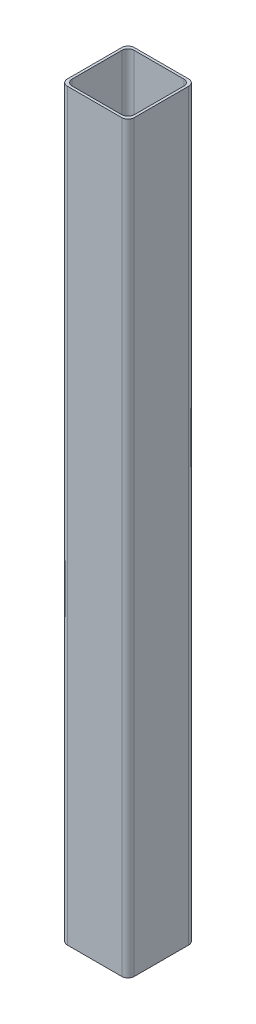
ISO-10303-21;
HEADER;
FILE_DESCRIPTION(('STEP AP214'),'2;1');
FILE_NAME('part.step','',(''),(''),'','','');
FILE_SCHEMA(('AUTOMOTIVE_DESIGN { 1 0 10303 214 1 1 1 1 }'));
ENDSEC;
DATA;
#1=APPLICATION_CONTEXT('core data for automotive mechanical design processes');
#2=APPLICATION_PROTOCOL_DEFINITION('international standard','automotive_design',2000,#1);
#3=PRODUCT_CONTEXT('',#1,'mechanical');
#4=PRODUCT('Part','Part','',(#3));
#5=PRODUCT_RELATED_PRODUCT_CATEGORY('part','',(#4));
#6=PRODUCT_DEFINITION_FORMATION('','',#4);
#7=PRODUCT_DEFINITION_CONTEXT('part definition',#1,'design');
#8=PRODUCT_DEFINITION('design','',#6,#7);
#9=PRODUCT_DEFINITION_SHAPE('','',#8);
#10=(LENGTH_UNIT() NAMED_UNIT(*) SI_UNIT(.MILLI.,.METRE.));
#11=(NAMED_UNIT(*) PLANE_ANGLE_UNIT() SI_UNIT($,.RADIAN.));
#12=(NAMED_UNIT(*) SI_UNIT($,.STERADIAN.) SOLID_ANGLE_UNIT());
#13=UNCERTAINTY_MEASURE_WITH_UNIT(LENGTH_MEASURE(1.E-05),#10,'distance_accuracy_value','');
#14=(GEOMETRIC_REPRESENTATION_CONTEXT(3) GLOBAL_UNCERTAINTY_ASSIGNED_CONTEXT((#13)) GLOBAL_UNIT_ASSIGNED_CONTEXT((#10,
#11,#12)) REPRESENTATION_CONTEXT('',''));
#15=CARTESIAN_POINT('',(0.,0.,0.));
#16=DIRECTION('',(0.,0.,1.));
#17=DIRECTION('',(1.,0.,0.));
#18=AXIS2_PLACEMENT_3D('',#15,#16,#17);
#19=CARTESIAN_POINT('',(11.176,304.8,-11.176));
#20=DIRECTION('',(0.,1.,0.));
#21=DIRECTION('',(0.,0.,1.));
#22=AXIS2_PLACEMENT_3D('',#19,#20,#21);
#23=PLANE('',#22);
#24=CARTESIAN_POINT('',(11.176,304.8,-11.176));
#25=DIRECTION('',(0.,1.,0.));
#26=DIRECTION('',(0.,0.,1.));
#27=AXIS2_PLACEMENT_3D('',#24,#25,#26);
#28=CIRCLE('',#27,2.54);
#29=CARTESIAN_POINT('',(13.716,304.8,-11.176));
#30=VERTEX_POINT('',#29);
#31=CARTESIAN_POINT('',(11.176,304.8,-13.716));
#32=VERTEX_POINT('',#31);
#33=EDGE_CURVE('E211',#30,#32,#28,.T.);
#34=ORIENTED_EDGE('',*,*,#33,.T.);
#35=DIRECTION('',(-1.,0.,0.));
#36=VECTOR('',#35,1.);
#37=CARTESIAN_POINT('',(-11.176,304.8,-13.716));
#38=LINE('',#37,#36);
#39=CARTESIAN_POINT('',(-11.176,304.8,-13.716));
#40=VERTEX_POINT('',#39);
#41=EDGE_CURVE('E214',#32,#40,#38,.T.);
#42=ORIENTED_EDGE('',*,*,#41,.T.);
#43=CARTESIAN_POINT('',(-11.176,304.8,-11.176));
#44=DIRECTION('',(0.,1.,0.));
#45=DIRECTION('',(0.,0.,-1.));
#46=AXIS2_PLACEMENT_3D('',#43,#44,#45);
#47=CIRCLE('',#46,2.54);
#48=CARTESIAN_POINT('',(-13.716,304.8,-11.176));
#49=VERTEX_POINT('',#48);
#50=EDGE_CURVE('E217',#40,#49,#47,.T.);
#51=ORIENTED_EDGE('',*,*,#50,.T.);
#52=DIRECTION('',(0.,0.,1.));
#53=VECTOR('',#52,1.);
#54=CARTESIAN_POINT('',(-13.716,304.8,11.176));
#55=LINE('',#54,#53);
#56=CARTESIAN_POINT('',(-13.716,304.8,11.176));
#57=VERTEX_POINT('',#56);
#58=EDGE_CURVE('E219',#49,#57,#55,.T.);
#59=ORIENTED_EDGE('',*,*,#58,.T.);
#60=CARTESIAN_POINT('',(-11.176,304.8,11.176));
#61=DIRECTION('',(0.,1.,0.));
#62=DIRECTION('',(0.,0.,-1.));
#63=AXIS2_PLACEMENT_3D('',#60,#61,#62);
#64=CIRCLE('',#63,2.54);
#65=CARTESIAN_POINT('',(-11.176,304.8,13.716));
#66=VERTEX_POINT('',#65);
#67=EDGE_CURVE('E221',#57,#66,#64,.T.);
#68=ORIENTED_EDGE('',*,*,#67,.T.);
#69=DIRECTION('',(1.,0.,0.));
#70=VECTOR('',#69,1.);
#71=CARTESIAN_POINT('',(-11.176,304.8,13.716));
#72=LINE('',#71,#70);
#73=CARTESIAN_POINT('',(11.176,304.8,13.716));
#74=VERTEX_POINT('',#73);
#75=EDGE_CURVE('E223',#66,#74,#72,.T.);
#76=ORIENTED_EDGE('',*,*,#75,.T.);
#77=CARTESIAN_POINT('',(11.176,304.8,11.176));
#78=DIRECTION('',(0.,1.,0.));
#79=DIRECTION('',(0.,0.,-1.));
#80=AXIS2_PLACEMENT_3D('',#77,#78,#79);
#81=CIRCLE('',#80,2.54);
#82=CARTESIAN_POINT('',(13.716,304.8,11.176));
#83=VERTEX_POINT('',#82);
#84=EDGE_CURVE('E225',#74,#83,#81,.T.);
#85=ORIENTED_EDGE('',*,*,#84,.T.);
#86=DIRECTION('',(0.,0.,-1.));
#87=VECTOR('',#86,1.);
#88=CARTESIAN_POINT('',(13.716,304.8,11.176));
#89=LINE('',#88,#87);
#90=EDGE_CURVE('E227',#83,#30,#89,.T.);
#91=ORIENTED_EDGE('',*,*,#90,.T.);
#92=EDGE_LOOP('',(#34,#42,#51,#59,#68,#76,#85,#91));
#93=FACE_BOUND('',#92,.T.);
#94=DIRECTION('',(0.,0.,-1.));
#95=VECTOR('',#94,1.);
#96=CARTESIAN_POINT('',(12.7,304.8,10.16));
#97=LINE('',#96,#95);
#98=CARTESIAN_POINT('',(12.7,304.8,10.16));
#99=VERTEX_POINT('',#98);
#100=CARTESIAN_POINT('',(12.7,304.8,-10.16));
#101=VERTEX_POINT('',#100);
#102=EDGE_CURVE('E154',#99,#101,#97,.T.);
#103=ORIENTED_EDGE('',*,*,#102,.F.);
#104=CARTESIAN_POINT('',(10.16,304.8,10.16));
#105=DIRECTION('',(0.,1.,0.));
#106=DIRECTION('',(0.,0.,-1.));
#107=AXIS2_PLACEMENT_3D('',#104,#105,#106);
#108=CIRCLE('',#107,2.54);
#109=CARTESIAN_POINT('',(10.16,304.8,12.7));
#110=VERTEX_POINT('',#109);
#111=EDGE_CURVE('E146',#110,#99,#108,.T.);
#112=ORIENTED_EDGE('',*,*,#111,.F.);
#113=DIRECTION('',(1.,0.,0.));
#114=VECTOR('',#113,1.);
#115=CARTESIAN_POINT('',(-10.16,304.8,12.7));
#116=LINE('',#115,#114);
#117=CARTESIAN_POINT('',(-10.16,304.8,12.7));
#118=VERTEX_POINT('',#117);
#119=EDGE_CURVE('E179',#118,#110,#116,.T.);
#120=ORIENTED_EDGE('',*,*,#119,.F.);
#121=CARTESIAN_POINT('',(-10.16,304.8,10.16));
#122=DIRECTION('',(0.,1.,0.));
#123=DIRECTION('',(0.,0.,-1.));
#124=AXIS2_PLACEMENT_3D('',#121,#122,#123);
#125=CIRCLE('',#124,2.54);
#126=CARTESIAN_POINT('',(-12.7,304.8,10.16));
#127=VERTEX_POINT('',#126);
#128=EDGE_CURVE('E177',#127,#118,#125,.T.);
#129=ORIENTED_EDGE('',*,*,#128,.F.);
#130=DIRECTION('',(0.,0.,1.));
#131=VECTOR('',#130,1.);
#132=CARTESIAN_POINT('',(-12.7,304.8,10.16));
#133=LINE('',#132,#131);
#134=CARTESIAN_POINT('',(-12.7,304.8,-10.16));
#135=VERTEX_POINT('',#134);
#136=EDGE_CURVE('E175',#135,#127,#133,.T.);
#137=ORIENTED_EDGE('',*,*,#136,.F.);
#138=CARTESIAN_POINT('',(-10.16,304.8,-10.16));
#139=DIRECTION('',(0.,1.,0.));
#140=DIRECTION('',(0.,0.,1.));
#141=AXIS2_PLACEMENT_3D('',#138,#139,#140);
#142=CIRCLE('',#141,2.54);
#143=CARTESIAN_POINT('',(-10.16,304.8,-12.7));
#144=VERTEX_POINT('',#143);
#145=EDGE_CURVE('E173',#144,#135,#142,.T.);
#146=ORIENTED_EDGE('',*,*,#145,.F.);
#147=DIRECTION('',(-1.,0.,0.));
#148=VECTOR('',#147,1.);
#149=CARTESIAN_POINT('',(-10.16,304.8,-12.7));
#150=LINE('',#149,#148);
#151=CARTESIAN_POINT('',(10.16,304.8,-12.7));
#152=VERTEX_POINT('',#151);
#153=EDGE_CURVE('E169',#152,#144,#150,.T.);
#154=ORIENTED_EDGE('',*,*,#153,.F.);
#155=CARTESIAN_POINT('',(10.16,304.8,-10.16));
#156=DIRECTION('',(0.,1.,0.));
#157=DIRECTION('',(0.,0.,1.));
#158=AXIS2_PLACEMENT_3D('',#155,#156,#157);
#159=CIRCLE('',#158,2.54);
#160=EDGE_CURVE('E167',#101,#152,#159,.T.);
#161=ORIENTED_EDGE('',*,*,#160,.F.);
#162=EDGE_LOOP('',(#103,#112,#120,#129,#137,#146,#154,#161));
#163=FACE_BOUND('',#162,.T.);
#164=ADVANCED_FACE('F33',(#93,#163),#23,.T.);
#165=CARTESIAN_POINT('',(11.176,0.,-11.176));
#166=DIRECTION('',(0.,1.,0.));
#167=DIRECTION('',(0.,0.,1.));
#168=AXIS2_PLACEMENT_3D('',#165,#166,#167);
#169=PLANE('',#168);
#170=CARTESIAN_POINT('',(11.176,0.,-11.176));
#171=DIRECTION('',(0.,1.,0.));
#172=DIRECTION('',(0.,0.,1.));
#173=AXIS2_PLACEMENT_3D('',#170,#171,#172);
#174=CIRCLE('',#173,2.54);
#175=CARTESIAN_POINT('',(13.716,0.,-11.176));
#176=VERTEX_POINT('',#175);
#177=CARTESIAN_POINT('',(11.176,0.,-13.716));
#178=VERTEX_POINT('',#177);
#179=EDGE_CURVE('E162',#176,#178,#174,.T.);
#180=ORIENTED_EDGE('',*,*,#179,.F.);
#181=DIRECTION('',(0.,0.,-1.));
#182=VECTOR('',#181,1.);
#183=CARTESIAN_POINT('',(13.716,0.,11.176));
#184=LINE('',#183,#182);
#185=CARTESIAN_POINT('',(13.716,0.,11.176));
#186=VERTEX_POINT('',#185);
#187=EDGE_CURVE('E215',#186,#176,#184,.T.);
#188=ORIENTED_EDGE('',*,*,#187,.F.);
#189=CARTESIAN_POINT('',(11.176,0.,11.176));
#190=DIRECTION('',(0.,1.,0.));
#191=DIRECTION('',(0.,0.,-1.));
#192=AXIS2_PLACEMENT_3D('',#189,#190,#191);
#193=CIRCLE('',#192,2.54);
#194=CARTESIAN_POINT('',(11.176,0.,13.716));
#195=VERTEX_POINT('',#194);
#196=EDGE_CURVE('E242',#195,#186,#193,.T.);
#197=ORIENTED_EDGE('',*,*,#196,.F.);
#198=DIRECTION('',(1.,0.,0.));
#199=VECTOR('',#198,1.);
#200=CARTESIAN_POINT('',(-11.176,0.,13.716));
#201=LINE('',#200,#199);
#202=CARTESIAN_POINT('',(-11.176,0.,13.716));
#203=VERTEX_POINT('',#202);
#204=EDGE_CURVE('E240',#203,#195,#201,.T.);
#205=ORIENTED_EDGE('',*,*,#204,.F.);
#206=CARTESIAN_POINT('',(-11.176,0.,11.176));
#207=DIRECTION('',(0.,1.,0.));
#208=DIRECTION('',(0.,0.,-1.));
#209=AXIS2_PLACEMENT_3D('',#206,#207,#208);
#210=CIRCLE('',#209,2.54);
#211=CARTESIAN_POINT('',(-13.716,0.,11.176));
#212=VERTEX_POINT('',#211);
#213=EDGE_CURVE('E238',#212,#203,#210,.T.);
#214=ORIENTED_EDGE('',*,*,#213,.F.);
#215=DIRECTION('',(0.,0.,1.));
#216=VECTOR('',#215,1.);
#217=CARTESIAN_POINT('',(-13.716,0.,11.176));
#218=LINE('',#217,#216);
#219=CARTESIAN_POINT('',(-13.716,0.,-11.176));
#220=VERTEX_POINT('',#219);
#221=EDGE_CURVE('E236',#220,#212,#218,.T.);
#222=ORIENTED_EDGE('',*,*,#221,.F.);
#223=CARTESIAN_POINT('',(-11.176,0.,-11.176));
#224=DIRECTION('',(0.,1.,0.));
#225=DIRECTION('',(0.,0.,-1.));
#226=AXIS2_PLACEMENT_3D('',#223,#224,#225);
#227=CIRCLE('',#226,2.54);
#228=CARTESIAN_POINT('',(-11.176,0.,-13.716));
#229=VERTEX_POINT('',#228);
#230=EDGE_CURVE('E234',#229,#220,#227,.T.);
#231=ORIENTED_EDGE('',*,*,#230,.F.);
#232=DIRECTION('',(-1.,0.,0.));
#233=VECTOR('',#232,1.);
#234=CARTESIAN_POINT('',(-11.176,0.,-13.716));
#235=LINE('',#234,#233);
#236=EDGE_CURVE('E232',#178,#229,#235,.T.);
#237=ORIENTED_EDGE('',*,*,#236,.F.);
#238=EDGE_LOOP('',(#180,#188,#197,#205,#214,#222,#231,#237));
#239=FACE_BOUND('',#238,.T.);
#240=CARTESIAN_POINT('',(10.16,0.,10.16));
#241=DIRECTION('',(0.,1.,0.));
#242=DIRECTION('',(0.,0.,-1.));
#243=AXIS2_PLACEMENT_3D('',#240,#241,#242);
#244=CIRCLE('',#243,2.54);
#245=CARTESIAN_POINT('',(10.16,0.,12.7));
#246=VERTEX_POINT('',#245);
#247=CARTESIAN_POINT('',(12.7,0.,10.16));
#248=VERTEX_POINT('',#247);
#249=EDGE_CURVE('E56',#246,#248,#244,.T.);
#250=ORIENTED_EDGE('',*,*,#249,.T.);
#251=DIRECTION('',(0.,0.,-1.));
#252=VECTOR('',#251,1.);
#253=CARTESIAN_POINT('',(12.7,0.,10.16));
#254=LINE('',#253,#252);
#255=CARTESIAN_POINT('',(12.7,0.,-10.16));
#256=VERTEX_POINT('',#255);
#257=EDGE_CURVE('E161',#248,#256,#254,.T.);
#258=ORIENTED_EDGE('',*,*,#257,.T.);
#259=CARTESIAN_POINT('',(10.16,0.,-10.16));
#260=DIRECTION('',(0.,1.,0.));
#261=DIRECTION('',(0.,0.,1.));
#262=AXIS2_PLACEMENT_3D('',#259,#260,#261);
#263=CIRCLE('',#262,2.54);
#264=CARTESIAN_POINT('',(10.16,0.,-12.7));
#265=VERTEX_POINT('',#264);
#266=EDGE_CURVE('E183',#256,#265,#263,.T.);
#267=ORIENTED_EDGE('',*,*,#266,.T.);
#268=DIRECTION('',(-1.,0.,0.));
#269=VECTOR('',#268,1.);
#270=CARTESIAN_POINT('',(-10.16,0.,-12.7));
#271=LINE('',#270,#269);
#272=CARTESIAN_POINT('',(-10.16,0.,-12.7));
#273=VERTEX_POINT('',#272);
#274=EDGE_CURVE('E186',#265,#273,#271,.T.);
#275=ORIENTED_EDGE('',*,*,#274,.T.);
#276=CARTESIAN_POINT('',(-10.16,0.,-10.16));
#277=DIRECTION('',(0.,1.,0.));
#278=DIRECTION('',(0.,0.,1.));
#279=AXIS2_PLACEMENT_3D('',#276,#277,#278);
#280=CIRCLE('',#279,2.54);
#281=CARTESIAN_POINT('',(-12.7,0.,-10.16));
#282=VERTEX_POINT('',#281);
#283=EDGE_CURVE('E189',#273,#282,#280,.T.);
#284=ORIENTED_EDGE('',*,*,#283,.T.);
#285=DIRECTION('',(0.,0.,1.));
#286=VECTOR('',#285,1.);
#287=CARTESIAN_POINT('',(-12.7,0.,10.16));
#288=LINE('',#287,#286);
#289=CARTESIAN_POINT('',(-12.7,0.,10.16));
#290=VERTEX_POINT('',#289);
#291=EDGE_CURVE('E192',#282,#290,#288,.T.);
#292=ORIENTED_EDGE('',*,*,#291,.T.);
#293=CARTESIAN_POINT('',(-10.16,0.,10.16));
#294=DIRECTION('',(0.,1.,0.));
#295=DIRECTION('',(0.,0.,-1.));
#296=AXIS2_PLACEMENT_3D('',#293,#294,#295);
#297=CIRCLE('',#296,2.54);
#298=CARTESIAN_POINT('',(-10.16,0.,12.7));
#299=VERTEX_POINT('',#298);
#300=EDGE_CURVE('E195',#290,#299,#297,.T.);
#301=ORIENTED_EDGE('',*,*,#300,.T.);
#302=DIRECTION('',(1.,0.,0.));
#303=VECTOR('',#302,1.);
#304=CARTESIAN_POINT('',(-10.16,0.,12.7));
#305=LINE('',#304,#303);
#306=EDGE_CURVE('E155',#299,#246,#305,.T.);
#307=ORIENTED_EDGE('',*,*,#306,.T.);
#308=EDGE_LOOP('',(#250,#258,#267,#275,#284,#292,#301,#307));
#309=FACE_BOUND('',#308,.T.);
#310=ADVANCED_FACE('F272',(#239,#309),#169,.F.);
#311=CARTESIAN_POINT('',(11.176,304.8,-11.176));
#312=DIRECTION('',(0.,-1.,0.));
#313=DIRECTION('',(0.,0.,-1.));
#314=AXIS2_PLACEMENT_3D('',#311,#312,#313);
#315=CYLINDRICAL_SURFACE('',#314,2.54);
#316=ORIENTED_EDGE('',*,*,#179,.T.);
#317=DIRECTION('',(0.,-1.,0.));
#318=VECTOR('',#317,1.);
#319=CARTESIAN_POINT('',(11.176,304.8,-13.716));
#320=LINE('',#319,#318);
#321=EDGE_CURVE('E11',#32,#178,#320,.T.);
#322=ORIENTED_EDGE('',*,*,#321,.F.);
#323=ORIENTED_EDGE('',*,*,#33,.F.);
#324=DIRECTION('',(0.,-1.,0.));
#325=VECTOR('',#324,1.);
#326=CARTESIAN_POINT('',(13.716,304.8,-11.176));
#327=LINE('',#326,#325);
#328=EDGE_CURVE('E229',#30,#176,#327,.T.);
#329=ORIENTED_EDGE('',*,*,#328,.T.);
#330=EDGE_LOOP('',(#316,#322,#323,#329));
#331=FACE_BOUND('',#330,.T.);
#332=ADVANCED_FACE('F35',(#331),#315,.T.);
#333=CARTESIAN_POINT('',(-11.176,304.8,-13.716));
#334=DIRECTION('',(0.,0.,1.));
#335=DIRECTION('',(1.,0.,0.));
#336=AXIS2_PLACEMENT_3D('',#333,#334,#335);
#337=PLANE('',#336);
#338=ORIENTED_EDGE('',*,*,#236,.T.);
#339=DIRECTION('',(0.,-1.,0.));
#340=VECTOR('',#339,1.);
#341=CARTESIAN_POINT('',(-11.176,304.8,-13.716));
#342=LINE('',#341,#340);
#343=EDGE_CURVE('E41',#40,#229,#342,.T.);
#344=ORIENTED_EDGE('',*,*,#343,.F.);
#345=ORIENTED_EDGE('',*,*,#41,.F.);
#346=ORIENTED_EDGE('',*,*,#321,.T.);
#347=EDGE_LOOP('',(#338,#344,#345,#346));
#348=FACE_BOUND('',#347,.T.);
#349=ADVANCED_FACE('F289',(#348),#337,.F.);
#350=CARTESIAN_POINT('',(-11.176,304.8,-11.176));
#351=DIRECTION('',(0.,-1.,0.));
#352=DIRECTION('',(0.,0.,-1.));
#353=AXIS2_PLACEMENT_3D('',#350,#351,#352);
#354=CYLINDRICAL_SURFACE('',#353,2.54);
#355=ORIENTED_EDGE('',*,*,#230,.T.);
#356=DIRECTION('',(0.,-1.,0.));
#357=VECTOR('',#356,1.);
#358=CARTESIAN_POINT('',(-13.716,304.8,-11.176));
#359=LINE('',#358,#357);
#360=EDGE_CURVE('E259',#49,#220,#359,.T.);
#361=ORIENTED_EDGE('',*,*,#360,.F.);
#362=ORIENTED_EDGE('',*,*,#50,.F.);
#363=ORIENTED_EDGE('',*,*,#343,.T.);
#364=EDGE_LOOP('',(#355,#361,#362,#363));
#365=FACE_BOUND('',#364,.T.);
#366=ADVANCED_FACE('F266',(#365),#354,.T.);
#367=CARTESIAN_POINT('',(-13.716,304.8,11.176));
#368=DIRECTION('',(1.,0.,0.));
#369=DIRECTION('',(0.,0.,-1.));
#370=AXIS2_PLACEMENT_3D('',#367,#368,#369);
#371=PLANE('',#370);
#372=ORIENTED_EDGE('',*,*,#221,.T.);
#373=DIRECTION('',(0.,-1.,0.));
#374=VECTOR('',#373,1.);
#375=CARTESIAN_POINT('',(-13.716,304.8,11.176));
#376=LINE('',#375,#374);
#377=EDGE_CURVE('E256',#57,#212,#376,.T.);
#378=ORIENTED_EDGE('',*,*,#377,.F.);
#379=ORIENTED_EDGE('',*,*,#58,.F.);
#380=ORIENTED_EDGE('',*,*,#360,.T.);
#381=EDGE_LOOP('',(#372,#378,#379,#380));
#382=FACE_BOUND('',#381,.T.);
#383=ADVANCED_FACE('F278',(#382),#371,.F.);
#384=CARTESIAN_POINT('',(-11.176,304.8,11.176));
#385=DIRECTION('',(0.,-1.,0.));
#386=DIRECTION('',(0.,0.,-1.));
#387=AXIS2_PLACEMENT_3D('',#384,#385,#386);
#388=CYLINDRICAL_SURFACE('',#387,2.54);
#389=ORIENTED_EDGE('',*,*,#213,.T.);
#390=DIRECTION('',(0.,-1.,0.));
#391=VECTOR('',#390,1.);
#392=CARTESIAN_POINT('',(-11.176,304.8,13.716));
#393=LINE('',#392,#391);
#394=EDGE_CURVE('E253',#66,#203,#393,.T.);
#395=ORIENTED_EDGE('',*,*,#394,.F.);
#396=ORIENTED_EDGE('',*,*,#67,.F.);
#397=ORIENTED_EDGE('',*,*,#377,.T.);
#398=EDGE_LOOP('',(#389,#395,#396,#397));
#399=FACE_BOUND('',#398,.T.);
#400=ADVANCED_FACE('F282',(#399),#388,.T.);
#401=CARTESIAN_POINT('',(-11.176,304.8,13.716));
#402=DIRECTION('',(0.,0.,-1.));
#403=DIRECTION('',(-1.,0.,0.));
#404=AXIS2_PLACEMENT_3D('',#401,#402,#403);
#405=PLANE('',#404);
#406=ORIENTED_EDGE('',*,*,#204,.T.);
#407=DIRECTION('',(0.,-1.,0.));
#408=VECTOR('',#407,1.);
#409=CARTESIAN_POINT('',(11.176,304.8,13.716));
#410=LINE('',#409,#408);
#411=EDGE_CURVE('E250',#74,#195,#410,.T.);
#412=ORIENTED_EDGE('',*,*,#411,.F.);
#413=ORIENTED_EDGE('',*,*,#75,.F.);
#414=ORIENTED_EDGE('',*,*,#394,.T.);
#415=EDGE_LOOP('',(#406,#412,#413,#414));
#416=FACE_BOUND('',#415,.T.);
#417=ADVANCED_FACE('F302',(#416),#405,.F.);
#418=CARTESIAN_POINT('',(11.176,304.8,11.176));
#419=DIRECTION('',(0.,-1.,0.));
#420=DIRECTION('',(0.,0.,-1.));
#421=AXIS2_PLACEMENT_3D('',#418,#419,#420);
#422=CYLINDRICAL_SURFACE('',#421,2.54);
#423=ORIENTED_EDGE('',*,*,#196,.T.);
#424=DIRECTION('',(0.,-1.,0.));
#425=VECTOR('',#424,1.);
#426=CARTESIAN_POINT('',(13.716,304.8,11.176));
#427=LINE('',#426,#425);
#428=EDGE_CURVE('E247',#83,#186,#427,.T.);
#429=ORIENTED_EDGE('',*,*,#428,.F.);
#430=ORIENTED_EDGE('',*,*,#84,.F.);
#431=ORIENTED_EDGE('',*,*,#411,.T.);
#432=EDGE_LOOP('',(#423,#429,#430,#431));
#433=FACE_BOUND('',#432,.T.);
#434=ADVANCED_FACE('F300',(#433),#422,.T.);
#435=CARTESIAN_POINT('',(13.716,304.8,11.176));
#436=DIRECTION('',(-1.,0.,0.));
#437=DIRECTION('',(0.,0.,1.));
#438=AXIS2_PLACEMENT_3D('',#435,#436,#437);
#439=PLANE('',#438);
#440=ORIENTED_EDGE('',*,*,#187,.T.);
#441=ORIENTED_EDGE('',*,*,#328,.F.);
#442=ORIENTED_EDGE('',*,*,#90,.F.);
#443=ORIENTED_EDGE('',*,*,#428,.T.);
#444=EDGE_LOOP('',(#440,#441,#442,#443));
#445=FACE_BOUND('',#444,.T.);
#446=ADVANCED_FACE('F295',(#445),#439,.F.);
#447=CARTESIAN_POINT('',(10.16,304.8,10.16));
#448=DIRECTION('',(0.,-1.,0.));
#449=DIRECTION('',(0.,0.,-1.));
#450=AXIS2_PLACEMENT_3D('',#447,#448,#449);
#451=CYLINDRICAL_SURFACE('',#450,2.54);
#452=ORIENTED_EDGE('',*,*,#249,.F.);
#453=DIRECTION('',(0.,-1.,0.));
#454=VECTOR('',#453,1.);
#455=CARTESIAN_POINT('',(10.16,304.8,12.7));
#456=LINE('',#455,#454);
#457=EDGE_CURVE('E150',#110,#246,#456,.T.);
#458=ORIENTED_EDGE('',*,*,#457,.F.);
#459=ORIENTED_EDGE('',*,*,#111,.T.);
#460=DIRECTION('',(0.,-1.,0.));
#461=VECTOR('',#460,1.);
#462=CARTESIAN_POINT('',(12.7,304.8,10.16));
#463=LINE('',#462,#461);
#464=EDGE_CURVE('E149',#99,#248,#463,.T.);
#465=ORIENTED_EDGE('',*,*,#464,.T.);
#466=EDGE_LOOP('',(#452,#458,#459,#465));
#467=FACE_BOUND('',#466,.T.);
#468=ADVANCED_FACE('F148',(#467),#451,.F.);
#469=CARTESIAN_POINT('',(12.7,304.8,10.16));
#470=DIRECTION('',(-1.,0.,0.));
#471=DIRECTION('',(0.,0.,1.));
#472=AXIS2_PLACEMENT_3D('',#469,#470,#471);
#473=PLANE('',#472);
#474=ORIENTED_EDGE('',*,*,#257,.F.);
#475=ORIENTED_EDGE('',*,*,#464,.F.);
#476=ORIENTED_EDGE('',*,*,#102,.T.);
#477=DIRECTION('',(0.,-1.,0.));
#478=VECTOR('',#477,1.);
#479=CARTESIAN_POINT('',(12.7,304.8,-10.16));
#480=LINE('',#479,#478);
#481=EDGE_CURVE('E163',#101,#256,#480,.T.);
#482=ORIENTED_EDGE('',*,*,#481,.T.);
#483=EDGE_LOOP('',(#474,#475,#476,#482));
#484=FACE_BOUND('',#483,.T.);
#485=ADVANCED_FACE('F158',(#484),#473,.T.);
#486=CARTESIAN_POINT('',(10.16,304.8,-10.16));
#487=DIRECTION('',(0.,-1.,0.));
#488=DIRECTION('',(0.,0.,-1.));
#489=AXIS2_PLACEMENT_3D('',#486,#487,#488);
#490=CYLINDRICAL_SURFACE('',#489,2.54);
#491=ORIENTED_EDGE('',*,*,#266,.F.);
#492=ORIENTED_EDGE('',*,*,#481,.F.);
#493=ORIENTED_EDGE('',*,*,#160,.T.);
#494=DIRECTION('',(0.,-1.,0.));
#495=VECTOR('',#494,1.);
#496=CARTESIAN_POINT('',(10.16,304.8,-12.7));
#497=LINE('',#496,#495);
#498=EDGE_CURVE('E208',#152,#265,#497,.T.);
#499=ORIENTED_EDGE('',*,*,#498,.T.);
#500=EDGE_LOOP('',(#491,#492,#493,#499));
#501=FACE_BOUND('',#500,.T.);
#502=ADVANCED_FACE('F327',(#501),#490,.F.);
#503=CARTESIAN_POINT('',(-10.16,304.8,-12.7));
#504=DIRECTION('',(0.,0.,1.));
#505=DIRECTION('',(1.,0.,0.));
#506=AXIS2_PLACEMENT_3D('',#503,#504,#505);
#507=PLANE('',#506);
#508=ORIENTED_EDGE('',*,*,#274,.F.);
#509=ORIENTED_EDGE('',*,*,#498,.F.);
#510=ORIENTED_EDGE('',*,*,#153,.T.);
#511=DIRECTION('',(0.,-1.,0.));
#512=VECTOR('',#511,1.);
#513=CARTESIAN_POINT('',(-10.16,304.8,-12.7));
#514=LINE('',#513,#512);
#515=EDGE_CURVE('E206',#144,#273,#514,.T.);
#516=ORIENTED_EDGE('',*,*,#515,.T.);
#517=EDGE_LOOP('',(#508,#509,#510,#516));
#518=FACE_BOUND('',#517,.T.);
#519=ADVANCED_FACE('F331',(#518),#507,.T.);
#520=CARTESIAN_POINT('',(-10.16,304.8,-10.16));
#521=DIRECTION('',(0.,-1.,0.));
#522=DIRECTION('',(0.,0.,-1.));
#523=AXIS2_PLACEMENT_3D('',#520,#521,#522);
#524=CYLINDRICAL_SURFACE('',#523,2.54);
#525=ORIENTED_EDGE('',*,*,#283,.F.);
#526=ORIENTED_EDGE('',*,*,#515,.F.);
#527=ORIENTED_EDGE('',*,*,#145,.T.);
#528=DIRECTION('',(0.,-1.,0.));
#529=VECTOR('',#528,1.);
#530=CARTESIAN_POINT('',(-12.7,304.8,-10.16));
#531=LINE('',#530,#529);
#532=EDGE_CURVE('E204',#135,#282,#531,.T.);
#533=ORIENTED_EDGE('',*,*,#532,.T.);
#534=EDGE_LOOP('',(#525,#526,#527,#533));
#535=FACE_BOUND('',#534,.T.);
#536=ADVANCED_FACE('F337',(#535),#524,.F.);
#537=CARTESIAN_POINT('',(-12.7,304.8,10.16));
#538=DIRECTION('',(1.,0.,0.));
#539=DIRECTION('',(0.,0.,-1.));
#540=AXIS2_PLACEMENT_3D('',#537,#538,#539);
#541=PLANE('',#540);
#542=ORIENTED_EDGE('',*,*,#291,.F.);
#543=ORIENTED_EDGE('',*,*,#532,.F.);
#544=ORIENTED_EDGE('',*,*,#136,.T.);
#545=DIRECTION('',(0.,-1.,0.));
#546=VECTOR('',#545,1.);
#547=CARTESIAN_POINT('',(-12.7,304.8,10.16));
#548=LINE('',#547,#546);
#549=EDGE_CURVE('E202',#127,#290,#548,.T.);
#550=ORIENTED_EDGE('',*,*,#549,.T.);
#551=EDGE_LOOP('',(#542,#543,#544,#550));
#552=FACE_BOUND('',#551,.T.);
#553=ADVANCED_FACE('F341',(#552),#541,.T.);
#554=CARTESIAN_POINT('',(-10.16,304.8,10.16));
#555=DIRECTION('',(0.,-1.,0.));
#556=DIRECTION('',(0.,0.,-1.));
#557=AXIS2_PLACEMENT_3D('',#554,#555,#556);
#558=CYLINDRICAL_SURFACE('',#557,2.54);
#559=ORIENTED_EDGE('',*,*,#300,.F.);
#560=ORIENTED_EDGE('',*,*,#549,.F.);
#561=ORIENTED_EDGE('',*,*,#128,.T.);
#562=DIRECTION('',(0.,-1.,0.));
#563=VECTOR('',#562,1.);
#564=CARTESIAN_POINT('',(-10.16,304.8,12.7));
#565=LINE('',#564,#563);
#566=EDGE_CURVE('E48',#118,#299,#565,.T.);
#567=ORIENTED_EDGE('',*,*,#566,.T.);
#568=EDGE_LOOP('',(#559,#560,#561,#567));
#569=FACE_BOUND('',#568,.T.);
#570=ADVANCED_FACE('F345',(#569),#558,.F.);
#571=CARTESIAN_POINT('',(-10.16,304.8,12.7));
#572=DIRECTION('',(0.,0.,-1.));
#573=DIRECTION('',(-1.,0.,0.));
#574=AXIS2_PLACEMENT_3D('',#571,#572,#573);
#575=PLANE('',#574);
#576=ORIENTED_EDGE('',*,*,#306,.F.);
#577=ORIENTED_EDGE('',*,*,#566,.F.);
#578=ORIENTED_EDGE('',*,*,#119,.T.);
#579=ORIENTED_EDGE('',*,*,#457,.T.);
#580=EDGE_LOOP('',(#576,#577,#578,#579));
#581=FACE_BOUND('',#580,.T.);
#582=ADVANCED_FACE('F349',(#581),#575,.T.);
#583=CLOSED_SHELL('',(#164,#310,#332,#349,#366,#383,#400,#417,#434,#446,#468,#485,#502,#519,
#536,#553,#570,#582));
#584=MANIFOLD_SOLID_BREP('B2',#583);
#585=ADVANCED_BREP_SHAPE_REPRESENTATION('',(#18,#584),#14);
#586=SHAPE_DEFINITION_REPRESENTATION(#9,#585);
ENDSEC;
END-ISO-10303-21;
